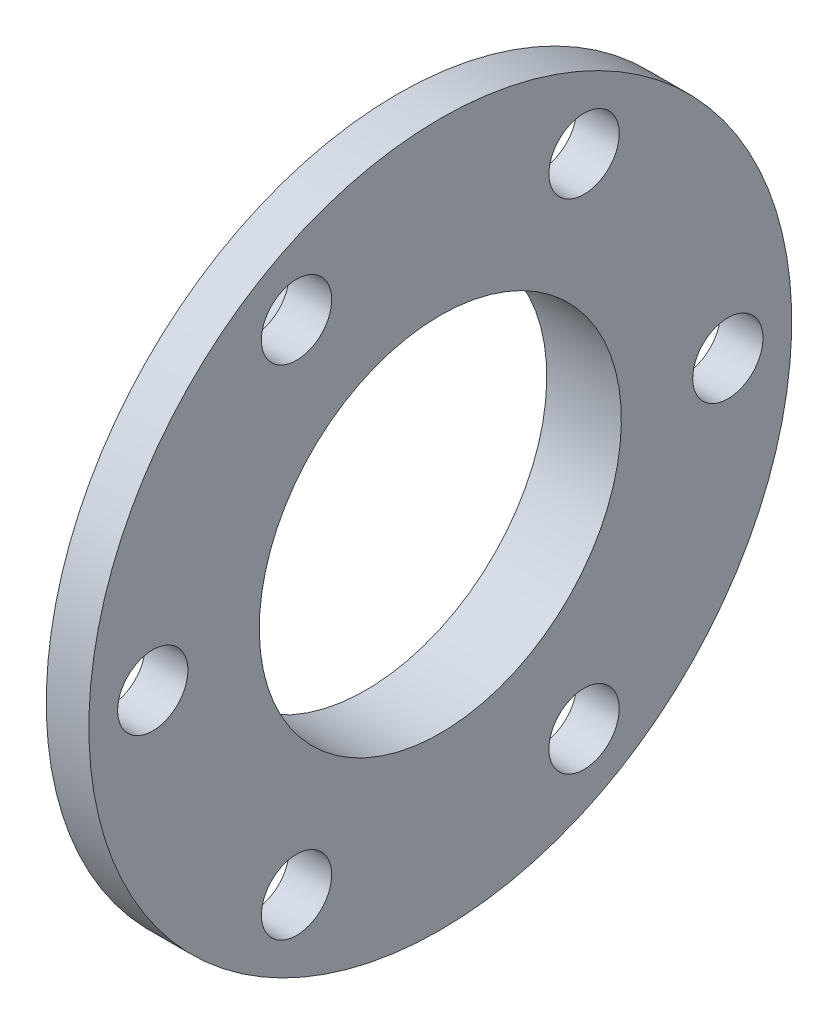
ISO-10303-21;
HEADER;
FILE_DESCRIPTION(('STEP AP214'),'2;1');
FILE_NAME('part.step','',(''),(''),'','','');
FILE_SCHEMA(('AUTOMOTIVE_DESIGN { 1 0 10303 214 1 1 1 1 }'));
ENDSEC;
DATA;
#1=APPLICATION_CONTEXT('core data for automotive mechanical design processes');
#2=APPLICATION_PROTOCOL_DEFINITION('international standard','automotive_design',2000,#1);
#3=PRODUCT_CONTEXT('',#1,'mechanical');
#4=PRODUCT('Part','Part','',(#3));
#5=PRODUCT_RELATED_PRODUCT_CATEGORY('part','',(#4));
#6=PRODUCT_DEFINITION_FORMATION('','',#4);
#7=PRODUCT_DEFINITION_CONTEXT('part definition',#1,'design');
#8=PRODUCT_DEFINITION('design','',#6,#7);
#9=PRODUCT_DEFINITION_SHAPE('','',#8);
#10=(LENGTH_UNIT() NAMED_UNIT(*) SI_UNIT(.MILLI.,.METRE.));
#11=(NAMED_UNIT(*) PLANE_ANGLE_UNIT() SI_UNIT($,.RADIAN.));
#12=(NAMED_UNIT(*) SI_UNIT($,.STERADIAN.) SOLID_ANGLE_UNIT());
#13=UNCERTAINTY_MEASURE_WITH_UNIT(LENGTH_MEASURE(1.E-05),#10,'distance_accuracy_value','');
#14=(GEOMETRIC_REPRESENTATION_CONTEXT(3) GLOBAL_UNCERTAINTY_ASSIGNED_CONTEXT((#13)) GLOBAL_UNIT_ASSIGNED_CONTEXT((#10,
#11,#12)) REPRESENTATION_CONTEXT('',''));
#15=CARTESIAN_POINT('',(0.,0.,0.));
#16=DIRECTION('',(0.,0.,1.));
#17=DIRECTION('',(1.,0.,0.));
#18=AXIS2_PLACEMENT_3D('',#15,#16,#17);
#19=CARTESIAN_POINT('',(-4.,0.,0.));
#20=DIRECTION('',(1.,0.,0.));
#21=DIRECTION('',(0.,1.,0.));
#22=AXIS2_PLACEMENT_3D('',#19,#20,#21);
#23=PLANE('',#22);
#24=CARTESIAN_POINT('',(-4.,0.,0.));
#25=DIRECTION('',(1.,0.,0.));
#26=DIRECTION('',(0.,1.,0.));
#27=AXIS2_PLACEMENT_3D('',#24,#25,#26);
#28=CIRCLE('',#27,33.);
#29=CARTESIAN_POINT('',(-4.,33.,0.));
#30=VERTEX_POINT('',#29);
#31=EDGE_CURVE('E49',#30,#30,#28,.T.);
#32=ORIENTED_EDGE('',*,*,#31,.F.);
#33=EDGE_LOOP('',(#32));
#34=FACE_BOUND('',#33,.T.);
#35=CARTESIAN_POINT('',(-4.,0.,0.));
#36=DIRECTION('',(1.,0.,0.));
#37=DIRECTION('',(0.,1.,0.));
#38=AXIS2_PLACEMENT_3D('',#35,#36,#37);
#39=CIRCLE('',#38,21.);
#40=CARTESIAN_POINT('',(-4.,21.,0.));
#41=VERTEX_POINT('',#40);
#42=EDGE_CURVE('E54',#41,#41,#39,.T.);
#43=ORIENTED_EDGE('',*,*,#42,.T.);
#44=EDGE_LOOP('',(#43));
#45=FACE_BOUND('',#44,.T.);
#46=CARTESIAN_POINT('',(-4.,0.,-27.));
#47=DIRECTION('',(-1.,0.,0.));
#48=DIRECTION('',(0.,0.,1.));
#49=AXIS2_PLACEMENT_3D('',#46,#47,#48);
#50=CIRCLE('',#49,3.29999999999999);
#51=CARTESIAN_POINT('',(-4.,0.,-23.7));
#52=VERTEX_POINT('',#51);
#53=EDGE_CURVE('E63',#52,#52,#50,.T.);
#54=ORIENTED_EDGE('',*,*,#53,.F.);
#55=EDGE_LOOP('',(#54));
#56=FACE_BOUND('',#55,.T.);
#57=CARTESIAN_POINT('',(-4.,23.3826859021799,-13.4999999999999));
#58=DIRECTION('',(-1.,0.,0.));
#59=DIRECTION('',(0.,0.,1.));
#60=AXIS2_PLACEMENT_3D('',#57,#58,#59);
#61=CIRCLE('',#60,3.29999999999999);
#62=CARTESIAN_POINT('',(-4.,23.3826859021799,-10.2));
#63=VERTEX_POINT('',#62);
#64=EDGE_CURVE('E69',#63,#63,#61,.T.);
#65=ORIENTED_EDGE('',*,*,#64,.F.);
#66=EDGE_LOOP('',(#65));
#67=FACE_BOUND('',#66,.T.);
#68=CARTESIAN_POINT('',(-4.,23.3826859021798,13.5000000000001));
#69=DIRECTION('',(-1.,0.,0.));
#70=DIRECTION('',(0.,0.,1.));
#71=AXIS2_PLACEMENT_3D('',#68,#69,#70);
#72=CIRCLE('',#71,3.29999999999999);
#73=CARTESIAN_POINT('',(-4.,23.3826859021798,16.8000000000001));
#74=VERTEX_POINT('',#73);
#75=EDGE_CURVE('E75',#74,#74,#72,.T.);
#76=ORIENTED_EDGE('',*,*,#75,.F.);
#77=EDGE_LOOP('',(#76));
#78=FACE_BOUND('',#77,.T.);
#79=CARTESIAN_POINT('',(-4.,0.,27.));
#80=DIRECTION('',(-1.,0.,0.));
#81=DIRECTION('',(0.,0.,1.));
#82=AXIS2_PLACEMENT_3D('',#79,#80,#81);
#83=CIRCLE('',#82,3.29999999999999);
#84=CARTESIAN_POINT('',(-4.,0.,30.3));
#85=VERTEX_POINT('',#84);
#86=EDGE_CURVE('E81',#85,#85,#83,.T.);
#87=ORIENTED_EDGE('',*,*,#86,.F.);
#88=EDGE_LOOP('',(#87));
#89=FACE_BOUND('',#88,.T.);
#90=CARTESIAN_POINT('',(-4.,-23.38268590218,13.4999999999998));
#91=DIRECTION('',(-1.,0.,0.));
#92=DIRECTION('',(0.,0.,1.));
#93=AXIS2_PLACEMENT_3D('',#90,#91,#92);
#94=CIRCLE('',#93,3.29999999999999);
#95=CARTESIAN_POINT('',(-4.,-23.38268590218,16.7999999999998));
#96=VERTEX_POINT('',#95);
#97=EDGE_CURVE('E87',#96,#96,#94,.T.);
#98=ORIENTED_EDGE('',*,*,#97,.F.);
#99=EDGE_LOOP('',(#98));
#100=FACE_BOUND('',#99,.T.);
#101=CARTESIAN_POINT('',(-4.,-23.3826859021797,-13.5000000000003));
#102=DIRECTION('',(-1.,0.,0.));
#103=DIRECTION('',(0.,0.,1.));
#104=AXIS2_PLACEMENT_3D('',#101,#102,#103);
#105=CIRCLE('',#104,3.29999999999999);
#106=CARTESIAN_POINT('',(-4.,-23.3826859021797,-10.2000000000003));
#107=VERTEX_POINT('',#106);
#108=EDGE_CURVE('E93',#107,#107,#105,.T.);
#109=ORIENTED_EDGE('',*,*,#108,.F.);
#110=EDGE_LOOP('',(#109));
#111=FACE_BOUND('',#110,.T.);
#112=ADVANCED_FACE('F34',(#34,#45,#56,#67,#78,#89,#100,#111),#23,.F.);
#113=CARTESIAN_POINT('',(-7.,0.,0.));
#114=DIRECTION('',(1.,0.,0.));
#115=DIRECTION('',(0.,1.,0.));
#116=AXIS2_PLACEMENT_3D('',#113,#114,#115);
#117=PLANE('',#116);
#118=CARTESIAN_POINT('',(-7.,0.,0.));
#119=DIRECTION('',(1.,0.,0.));
#120=DIRECTION('',(0.,1.,0.));
#121=AXIS2_PLACEMENT_3D('',#118,#119,#120);
#122=CIRCLE('',#121,21.);
#123=CARTESIAN_POINT('',(-7.,21.,0.));
#124=VERTEX_POINT('',#123);
#125=EDGE_CURVE('E57',#124,#124,#122,.T.);
#126=ORIENTED_EDGE('',*,*,#125,.F.);
#127=EDGE_LOOP('',(#126));
#128=FACE_BOUND('',#127,.T.);
#129=CARTESIAN_POINT('',(-7.,0.,0.));
#130=DIRECTION('',(1.,0.,0.));
#131=DIRECTION('',(0.,1.,0.));
#132=AXIS2_PLACEMENT_3D('',#129,#130,#131);
#133=CIRCLE('',#132,17.);
#134=CARTESIAN_POINT('',(-7.,17.,0.));
#135=VERTEX_POINT('',#134);
#136=EDGE_CURVE('E10',#135,#135,#133,.T.);
#137=ORIENTED_EDGE('',*,*,#136,.T.);
#138=EDGE_LOOP('',(#137));
#139=FACE_BOUND('',#138,.T.);
#140=ADVANCED_FACE('F36',(#128,#139),#117,.F.);
#141=CARTESIAN_POINT('',(0.,0.,0.));
#142=DIRECTION('',(1.,0.,0.));
#143=DIRECTION('',(0.,1.,0.));
#144=AXIS2_PLACEMENT_3D('',#141,#142,#143);
#145=CYLINDRICAL_SURFACE('',#144,17.);
#146=CARTESIAN_POINT('',(0.,0.,0.));
#147=DIRECTION('',(1.,0.,0.));
#148=DIRECTION('',(0.,1.,0.));
#149=AXIS2_PLACEMENT_3D('',#146,#147,#148);
#150=CIRCLE('',#149,17.);
#151=CARTESIAN_POINT('',(0.,17.,0.));
#152=VERTEX_POINT('',#151);
#153=EDGE_CURVE('E41',#152,#152,#150,.T.);
#154=ORIENTED_EDGE('',*,*,#153,.T.);
#155=EDGE_LOOP('',(#154));
#156=FACE_BOUND('',#155,.T.);
#157=ORIENTED_EDGE('',*,*,#136,.F.);
#158=EDGE_LOOP('',(#157));
#159=FACE_BOUND('',#158,.T.);
#160=ADVANCED_FACE('F105',(#156,#159),#145,.F.);
#161=CARTESIAN_POINT('',(0.,0.,0.));
#162=DIRECTION('',(-1.,0.,0.));
#163=DIRECTION('',(0.,-1.,0.));
#164=AXIS2_PLACEMENT_3D('',#161,#162,#163);
#165=PLANE('',#164);
#166=CARTESIAN_POINT('',(0.,-23.3826859021797,-13.5000000000003));
#167=DIRECTION('',(-1.,0.,0.));
#168=DIRECTION('',(0.,-1.,0.));
#169=AXIS2_PLACEMENT_3D('',#166,#167,#168);
#170=CIRCLE('',#169,3.29999999999999);
#171=CARTESIAN_POINT('',(0.,-26.6826859021797,-13.5000000000003));
#172=VERTEX_POINT('',#171);
#173=EDGE_CURVE('E90',#172,#172,#170,.T.);
#174=ORIENTED_EDGE('',*,*,#173,.T.);
#175=EDGE_LOOP('',(#174));
#176=FACE_BOUND('',#175,.T.);
#177=CARTESIAN_POINT('',(0.,-23.38268590218,13.4999999999998));
#178=DIRECTION('',(-1.,0.,0.));
#179=DIRECTION('',(0.,-1.,0.));
#180=AXIS2_PLACEMENT_3D('',#177,#178,#179);
#181=CIRCLE('',#180,3.29999999999999);
#182=CARTESIAN_POINT('',(0.,-26.68268590218,13.4999999999998));
#183=VERTEX_POINT('',#182);
#184=EDGE_CURVE('E84',#183,#183,#181,.T.);
#185=ORIENTED_EDGE('',*,*,#184,.T.);
#186=EDGE_LOOP('',(#185));
#187=FACE_BOUND('',#186,.T.);
#188=CARTESIAN_POINT('',(0.,0.,27.));
#189=DIRECTION('',(-1.,0.,0.));
#190=DIRECTION('',(0.,-1.,0.));
#191=AXIS2_PLACEMENT_3D('',#188,#189,#190);
#192=CIRCLE('',#191,3.29999999999999);
#193=CARTESIAN_POINT('',(0.,-3.29999999999999,27.));
#194=VERTEX_POINT('',#193);
#195=EDGE_CURVE('E78',#194,#194,#192,.T.);
#196=ORIENTED_EDGE('',*,*,#195,.T.);
#197=EDGE_LOOP('',(#196));
#198=FACE_BOUND('',#197,.T.);
#199=CARTESIAN_POINT('',(0.,23.3826859021798,13.5000000000001));
#200=DIRECTION('',(-1.,0.,0.));
#201=DIRECTION('',(0.,-1.,0.));
#202=AXIS2_PLACEMENT_3D('',#199,#200,#201);
#203=CIRCLE('',#202,3.29999999999999);
#204=CARTESIAN_POINT('',(0.,20.0826859021798,13.5000000000001));
#205=VERTEX_POINT('',#204);
#206=EDGE_CURVE('E72',#205,#205,#203,.T.);
#207=ORIENTED_EDGE('',*,*,#206,.T.);
#208=EDGE_LOOP('',(#207));
#209=FACE_BOUND('',#208,.T.);
#210=CARTESIAN_POINT('',(0.,23.3826859021799,-13.4999999999999));
#211=DIRECTION('',(-1.,0.,0.));
#212=DIRECTION('',(0.,-1.,0.));
#213=AXIS2_PLACEMENT_3D('',#210,#211,#212);
#214=CIRCLE('',#213,3.29999999999999);
#215=CARTESIAN_POINT('',(0.,20.0826859021799,-13.4999999999999));
#216=VERTEX_POINT('',#215);
#217=EDGE_CURVE('E66',#216,#216,#214,.T.);
#218=ORIENTED_EDGE('',*,*,#217,.T.);
#219=EDGE_LOOP('',(#218));
#220=FACE_BOUND('',#219,.T.);
#221=CARTESIAN_POINT('',(0.,0.,-27.));
#222=DIRECTION('',(-1.,0.,0.));
#223=DIRECTION('',(0.,-1.,0.));
#224=AXIS2_PLACEMENT_3D('',#221,#222,#223);
#225=CIRCLE('',#224,3.29999999999999);
#226=CARTESIAN_POINT('',(0.,-3.29999999999999,-27.));
#227=VERTEX_POINT('',#226);
#228=EDGE_CURVE('E60',#227,#227,#225,.T.);
#229=ORIENTED_EDGE('',*,*,#228,.T.);
#230=EDGE_LOOP('',(#229));
#231=FACE_BOUND('',#230,.T.);
#232=ORIENTED_EDGE('',*,*,#153,.F.);
#233=EDGE_LOOP('',(#232));
#234=FACE_BOUND('',#233,.T.);
#235=CARTESIAN_POINT('',(0.,0.,0.));
#236=DIRECTION('',(1.,0.,0.));
#237=DIRECTION('',(0.,1.,0.));
#238=AXIS2_PLACEMENT_3D('',#235,#236,#237);
#239=CIRCLE('',#238,33.);
#240=CARTESIAN_POINT('',(0.,33.,0.));
#241=VERTEX_POINT('',#240);
#242=EDGE_CURVE('E45',#241,#241,#239,.T.);
#243=ORIENTED_EDGE('',*,*,#242,.T.);
#244=EDGE_LOOP('',(#243));
#245=FACE_BOUND('',#244,.T.);
#246=ADVANCED_FACE('F116',(#176,#187,#198,#209,#220,#231,#234,#245),#165,.F.);
#247=CARTESIAN_POINT('',(0.,0.,0.));
#248=DIRECTION('',(1.,0.,0.));
#249=DIRECTION('',(0.,1.,0.));
#250=AXIS2_PLACEMENT_3D('',#247,#248,#249);
#251=CYLINDRICAL_SURFACE('',#250,33.);
#252=ORIENTED_EDGE('',*,*,#242,.F.);
#253=EDGE_LOOP('',(#252));
#254=FACE_BOUND('',#253,.T.);
#255=ORIENTED_EDGE('',*,*,#31,.T.);
#256=EDGE_LOOP('',(#255));
#257=FACE_BOUND('',#256,.T.);
#258=ADVANCED_FACE('F113',(#254,#257),#251,.T.);
#259=CARTESIAN_POINT('',(0.,0.,0.));
#260=DIRECTION('',(1.,0.,0.));
#261=DIRECTION('',(0.,1.,0.));
#262=AXIS2_PLACEMENT_3D('',#259,#260,#261);
#263=CYLINDRICAL_SURFACE('',#262,21.);
#264=ORIENTED_EDGE('',*,*,#42,.F.);
#265=EDGE_LOOP('',(#264));
#266=FACE_BOUND('',#265,.T.);
#267=ORIENTED_EDGE('',*,*,#125,.T.);
#268=EDGE_LOOP('',(#267));
#269=FACE_BOUND('',#268,.T.);
#270=ADVANCED_FACE('F111',(#266,#269),#263,.T.);
#271=CARTESIAN_POINT('',(-4.,0.,-27.));
#272=DIRECTION('',(-1.,0.,0.));
#273=DIRECTION('',(0.,0.,1.));
#274=AXIS2_PLACEMENT_3D('',#271,#272,#273);
#275=CYLINDRICAL_SURFACE('',#274,3.29999999999999);
#276=ORIENTED_EDGE('',*,*,#228,.F.);
#277=EDGE_LOOP('',(#276));
#278=FACE_BOUND('',#277,.T.);
#279=ORIENTED_EDGE('',*,*,#53,.T.);
#280=EDGE_LOOP('',(#279));
#281=FACE_BOUND('',#280,.T.);
#282=ADVANCED_FACE('F141',(#278,#281),#275,.F.);
#283=CARTESIAN_POINT('',(-4.,23.3826859021799,-13.4999999999999));
#284=DIRECTION('',(-1.,0.,0.));
#285=DIRECTION('',(0.,0.,1.));
#286=AXIS2_PLACEMENT_3D('',#283,#284,#285);
#287=CYLINDRICAL_SURFACE('',#286,3.29999999999999);
#288=ORIENTED_EDGE('',*,*,#217,.F.);
#289=EDGE_LOOP('',(#288));
#290=FACE_BOUND('',#289,.T.);
#291=ORIENTED_EDGE('',*,*,#64,.T.);
#292=EDGE_LOOP('',(#291));
#293=FACE_BOUND('',#292,.T.);
#294=ADVANCED_FACE('F148',(#290,#293),#287,.F.);
#295=CARTESIAN_POINT('',(-4.,23.3826859021798,13.5000000000001));
#296=DIRECTION('',(-1.,0.,0.));
#297=DIRECTION('',(0.,0.,1.));
#298=AXIS2_PLACEMENT_3D('',#295,#296,#297);
#299=CYLINDRICAL_SURFACE('',#298,3.29999999999999);
#300=ORIENTED_EDGE('',*,*,#206,.F.);
#301=EDGE_LOOP('',(#300));
#302=FACE_BOUND('',#301,.T.);
#303=ORIENTED_EDGE('',*,*,#75,.T.);
#304=EDGE_LOOP('',(#303));
#305=FACE_BOUND('',#304,.T.);
#306=ADVANCED_FACE('F154',(#302,#305),#299,.F.);
#307=CARTESIAN_POINT('',(-4.,0.,27.));
#308=DIRECTION('',(-1.,0.,0.));
#309=DIRECTION('',(0.,0.,1.));
#310=AXIS2_PLACEMENT_3D('',#307,#308,#309);
#311=CYLINDRICAL_SURFACE('',#310,3.29999999999999);
#312=ORIENTED_EDGE('',*,*,#195,.F.);
#313=EDGE_LOOP('',(#312));
#314=FACE_BOUND('',#313,.T.);
#315=ORIENTED_EDGE('',*,*,#86,.T.);
#316=EDGE_LOOP('',(#315));
#317=FACE_BOUND('',#316,.T.);
#318=ADVANCED_FACE('F162',(#314,#317),#311,.F.);
#319=CARTESIAN_POINT('',(-4.,-23.38268590218,13.4999999999998));
#320=DIRECTION('',(-1.,0.,0.));
#321=DIRECTION('',(0.,0.,1.));
#322=AXIS2_PLACEMENT_3D('',#319,#320,#321);
#323=CYLINDRICAL_SURFACE('',#322,3.29999999999999);
#324=ORIENTED_EDGE('',*,*,#184,.F.);
#325=EDGE_LOOP('',(#324));
#326=FACE_BOUND('',#325,.T.);
#327=ORIENTED_EDGE('',*,*,#97,.T.);
#328=EDGE_LOOP('',(#327));
#329=FACE_BOUND('',#328,.T.);
#330=ADVANCED_FACE('F170',(#326,#329),#323,.F.);
#331=CARTESIAN_POINT('',(-4.,-23.3826859021797,-13.5000000000003));
#332=DIRECTION('',(-1.,0.,0.));
#333=DIRECTION('',(0.,0.,1.));
#334=AXIS2_PLACEMENT_3D('',#331,#332,#333);
#335=CYLINDRICAL_SURFACE('',#334,3.29999999999999);
#336=ORIENTED_EDGE('',*,*,#173,.F.);
#337=EDGE_LOOP('',(#336));
#338=FACE_BOUND('',#337,.T.);
#339=ORIENTED_EDGE('',*,*,#108,.T.);
#340=EDGE_LOOP('',(#339));
#341=FACE_BOUND('',#340,.T.);
#342=ADVANCED_FACE('F97',(#338,#341),#335,.F.);
#343=CLOSED_SHELL('',(#112,#140,#160,#246,#258,#270,#282,#294,#306,#318,#330,#342));
#344=MANIFOLD_SOLID_BREP('B2',#343);
#345=ADVANCED_BREP_SHAPE_REPRESENTATION('',(#18,#344),#14);
#346=SHAPE_DEFINITION_REPRESENTATION(#9,#345);
ENDSEC;
END-ISO-10303-21;
